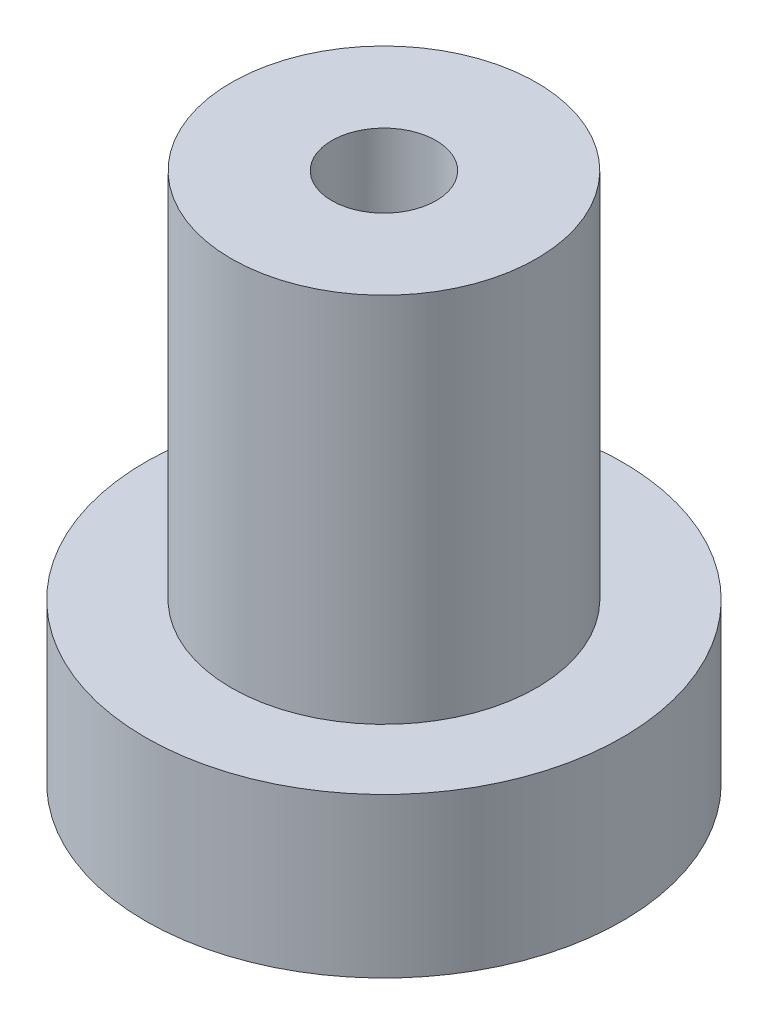
ISO-10303-21;
HEADER;
FILE_DESCRIPTION(('STEP AP214'),'2;1');
FILE_NAME('part.step','',(''),(''),'','','');
FILE_SCHEMA(('AUTOMOTIVE_DESIGN { 1 0 10303 214 1 1 1 1 }'));
ENDSEC;
DATA;
#1=APPLICATION_CONTEXT('core data for automotive mechanical design processes');
#2=APPLICATION_PROTOCOL_DEFINITION('international standard','automotive_design',2000,#1);
#3=PRODUCT_CONTEXT('',#1,'mechanical');
#4=PRODUCT('Part','Part','',(#3));
#5=PRODUCT_RELATED_PRODUCT_CATEGORY('part','',(#4));
#6=PRODUCT_DEFINITION_FORMATION('','',#4);
#7=PRODUCT_DEFINITION_CONTEXT('part definition',#1,'design');
#8=PRODUCT_DEFINITION('design','',#6,#7);
#9=PRODUCT_DEFINITION_SHAPE('','',#8);
#10=(LENGTH_UNIT() NAMED_UNIT(*) SI_UNIT(.MILLI.,.METRE.));
#11=(NAMED_UNIT(*) PLANE_ANGLE_UNIT() SI_UNIT($,.RADIAN.));
#12=(NAMED_UNIT(*) SI_UNIT($,.STERADIAN.) SOLID_ANGLE_UNIT());
#13=UNCERTAINTY_MEASURE_WITH_UNIT(LENGTH_MEASURE(1.E-05),#10,'distance_accuracy_value','');
#14=(GEOMETRIC_REPRESENTATION_CONTEXT(3) GLOBAL_UNCERTAINTY_ASSIGNED_CONTEXT((#13)) GLOBAL_UNIT_ASSIGNED_CONTEXT((#10,
#11,#12)) REPRESENTATION_CONTEXT('',''));
#15=CARTESIAN_POINT('',(0.,0.,0.));
#16=DIRECTION('',(0.,0.,1.));
#17=DIRECTION('',(1.,0.,0.));
#18=AXIS2_PLACEMENT_3D('',#15,#16,#17);
#19=CARTESIAN_POINT('',(0.,21.193,0.));
#20=DIRECTION('',(0.,1.,0.));
#21=DIRECTION('',(0.,0.,1.));
#22=AXIS2_PLACEMENT_3D('',#19,#20,#21);
#23=CYLINDRICAL_SURFACE('',#22,2.08279999999999);
#24=CARTESIAN_POINT('',(0.,21.193,0.));
#25=DIRECTION('',(0.,1.,0.));
#26=DIRECTION('',(0.,0.,1.));
#27=AXIS2_PLACEMENT_3D('',#24,#25,#26);
#28=CIRCLE('',#27,2.08279999999999);
#29=CARTESIAN_POINT('',(0.,21.193,2.08279999999999));
#30=VERTEX_POINT('',#29);
#31=EDGE_CURVE('E146',#30,#30,#28,.T.);
#32=ORIENTED_EDGE('',*,*,#31,.T.);
#33=EDGE_LOOP('',(#32));
#34=FACE_BOUND('',#33,.T.);
#35=CARTESIAN_POINT('',(0.,3.556,0.));
#36=DIRECTION('',(0.,-1.,0.));
#37=DIRECTION('',(0.,0.,-1.));
#38=AXIS2_PLACEMENT_3D('',#35,#36,#37);
#39=CIRCLE('',#38,2.08279999999999);
#40=CARTESIAN_POINT('',(0.,3.556,-2.08279999999999));
#41=VERTEX_POINT('',#40);
#42=EDGE_CURVE('E41',#41,#41,#39,.F.);
#43=ORIENTED_EDGE('',*,*,#42,.F.);
#44=EDGE_LOOP('',(#43));
#45=FACE_BOUND('',#44,.T.);
#46=ADVANCED_FACE('F37',(#34,#45),#23,.F.);
#47=CARTESIAN_POINT('',(0.,0.,0.));
#48=DIRECTION('',(0.,1.,0.));
#49=DIRECTION('',(0.,0.,1.));
#50=AXIS2_PLACEMENT_3D('',#47,#48,#49);
#51=PLANE('',#50);
#52=DIRECTION('',(-0.999047500513866,0.,-0.0436358994063032));
#53=VECTOR('',#52,1.);
#54=CARTESIAN_POINT('',(2.36991595335153,0.,4.55274990608789));
#55=LINE('',#54,#53);
#56=CARTESIAN_POINT('',(2.36991595335153,0.,4.55274990608788));
#57=VERTEX_POINT('',#56);
#58=CARTESIAN_POINT('',(-2.75783909907356,0.,4.32878237348038));
#59=VERTEX_POINT('',#58);
#60=EDGE_CURVE('E128',#57,#59,#55,.T.);
#61=ORIENTED_EDGE('',*,*,#60,.F.);
#62=DIRECTION('',(-0.537313547659773,0.,0.843382565329204));
#63=VECTOR('',#62,1.);
#64=CARTESIAN_POINT('',(5.12775505242509,0.,0.223967532607504));
#65=LINE('',#64,#63);
#66=CARTESIAN_POINT('',(5.12775505242509,0.,0.223967532607504));
#67=VERTEX_POINT('',#66);
#68=EDGE_CURVE('E53',#67,#57,#65,.T.);
#69=ORIENTED_EDGE('',*,*,#68,.F.);
#70=DIRECTION('',(0.461733952854093,0.,0.887018464735506));
#71=VECTOR('',#70,1.);
#72=CARTESIAN_POINT('',(2.75783909907356,0.,-4.32878237348038));
#73=LINE('',#72,#71);
#74=CARTESIAN_POINT('',(2.75783909907356,0.,-4.32878237348038));
#75=VERTEX_POINT('',#74);
#76=EDGE_CURVE('E137',#75,#67,#73,.T.);
#77=ORIENTED_EDGE('',*,*,#76,.F.);
#78=DIRECTION('',(0.999047500513866,0.,0.0436358994063029));
#79=VECTOR('',#78,1.);
#80=CARTESIAN_POINT('',(-2.36991595335153,0.,-4.55274990608788));
#81=LINE('',#80,#79);
#82=CARTESIAN_POINT('',(-2.36991595335153,0.,-4.55274990608788));
#83=VERTEX_POINT('',#82);
#84=EDGE_CURVE('E135',#83,#75,#81,.T.);
#85=ORIENTED_EDGE('',*,*,#84,.F.);
#86=DIRECTION('',(0.537313547659773,0.,-0.843382565329204));
#87=VECTOR('',#86,1.);
#88=CARTESIAN_POINT('',(-5.12775505242509,0.,-0.223967532607501));
#89=LINE('',#88,#87);
#90=CARTESIAN_POINT('',(-5.12775505242509,0.,-0.223967532607501));
#91=VERTEX_POINT('',#90);
#92=EDGE_CURVE('E101',#91,#83,#89,.T.);
#93=ORIENTED_EDGE('',*,*,#92,.F.);
#94=DIRECTION('',(-0.461733952854092,0.,-0.887018464735506));
#95=VECTOR('',#94,1.);
#96=CARTESIAN_POINT('',(-2.75783909907356,0.,4.32878237348038));
#97=LINE('',#96,#95);
#98=EDGE_CURVE('E131',#59,#91,#97,.T.);
#99=ORIENTED_EDGE('',*,*,#98,.F.);
#100=EDGE_LOOP('',(#61,#69,#77,#85,#93,#99));
#101=FACE_BOUND('',#100,.T.);
#102=CARTESIAN_POINT('',(0.,0.,0.));
#103=DIRECTION('',(0.,1.,0.));
#104=DIRECTION('',(0.,0.,1.));
#105=AXIS2_PLACEMENT_3D('',#102,#103,#104);
#106=CIRCLE('',#105,9.525);
#107=CARTESIAN_POINT('',(0.,0.,9.525));
#108=VERTEX_POINT('',#107);
#109=EDGE_CURVE('E11',#108,#108,#106,.T.);
#110=ORIENTED_EDGE('',*,*,#109,.F.);
#111=EDGE_LOOP('',(#110));
#112=FACE_BOUND('',#111,.T.);
#113=ADVANCED_FACE('F39',(#101,#112),#51,.F.);
#114=CARTESIAN_POINT('',(0.,21.193,0.));
#115=DIRECTION('',(0.,1.,0.));
#116=DIRECTION('',(0.,0.,1.));
#117=AXIS2_PLACEMENT_3D('',#114,#115,#116);
#118=CYLINDRICAL_SURFACE('',#117,9.525);
#119=CARTESIAN_POINT('',(0.,6.35,0.));
#120=DIRECTION('',(0.,1.,0.));
#121=DIRECTION('',(0.,0.,1.));
#122=AXIS2_PLACEMENT_3D('',#119,#120,#121);
#123=CIRCLE('',#122,9.525);
#124=CARTESIAN_POINT('',(0.,6.35,9.525));
#125=VERTEX_POINT('',#124);
#126=EDGE_CURVE('E46',#125,#125,#123,.T.);
#127=ORIENTED_EDGE('',*,*,#126,.F.);
#128=EDGE_LOOP('',(#127));
#129=FACE_BOUND('',#128,.T.);
#130=ORIENTED_EDGE('',*,*,#109,.T.);
#131=EDGE_LOOP('',(#130));
#132=FACE_BOUND('',#131,.T.);
#133=ADVANCED_FACE('F160',(#129,#132),#118,.T.);
#134=CARTESIAN_POINT('',(9.525,6.35,0.));
#135=DIRECTION('',(0.,-1.,0.));
#136=DIRECTION('',(0.,0.,-1.));
#137=AXIS2_PLACEMENT_3D('',#134,#135,#136);
#138=PLANE('',#137);
#139=CARTESIAN_POINT('',(0.,6.35000000000001,0.));
#140=DIRECTION('',(0.,1.,0.));
#141=DIRECTION('',(0.,0.,1.));
#142=AXIS2_PLACEMENT_3D('',#139,#140,#141);
#143=CIRCLE('',#142,6.096);
#144=CARTESIAN_POINT('',(0.,6.35000000000001,6.096));
#145=VERTEX_POINT('',#144);
#146=EDGE_CURVE('E152',#145,#145,#143,.T.);
#147=ORIENTED_EDGE('',*,*,#146,.F.);
#148=EDGE_LOOP('',(#147));
#149=FACE_BOUND('',#148,.T.);
#150=ORIENTED_EDGE('',*,*,#126,.T.);
#151=EDGE_LOOP('',(#150));
#152=FACE_BOUND('',#151,.T.);
#153=ADVANCED_FACE('F158',(#149,#152),#138,.F.);
#154=CARTESIAN_POINT('',(0.,21.193,0.));
#155=DIRECTION('',(0.,1.,0.));
#156=DIRECTION('',(0.,0.,1.));
#157=AXIS2_PLACEMENT_3D('',#154,#155,#156);
#158=CYLINDRICAL_SURFACE('',#157,6.096);
#159=CARTESIAN_POINT('',(0.,21.193,0.));
#160=DIRECTION('',(0.,1.,0.));
#161=DIRECTION('',(0.,0.,1.));
#162=AXIS2_PLACEMENT_3D('',#159,#160,#161);
#163=CIRCLE('',#162,6.096);
#164=CARTESIAN_POINT('',(0.,21.193,6.096));
#165=VERTEX_POINT('',#164);
#166=EDGE_CURVE('E149',#165,#165,#163,.T.);
#167=ORIENTED_EDGE('',*,*,#166,.F.);
#168=EDGE_LOOP('',(#167));
#169=FACE_BOUND('',#168,.T.);
#170=ORIENTED_EDGE('',*,*,#146,.T.);
#171=EDGE_LOOP('',(#170));
#172=FACE_BOUND('',#171,.T.);
#173=ADVANCED_FACE('F194',(#169,#172),#158,.T.);
#174=CARTESIAN_POINT('',(6.096,21.193,0.));
#175=DIRECTION('',(0.,-1.,0.));
#176=DIRECTION('',(0.,0.,-1.));
#177=AXIS2_PLACEMENT_3D('',#174,#175,#176);
#178=PLANE('',#177);
#179=ORIENTED_EDGE('',*,*,#31,.F.);
#180=EDGE_LOOP('',(#179));
#181=FACE_BOUND('',#180,.T.);
#182=ORIENTED_EDGE('',*,*,#166,.T.);
#183=EDGE_LOOP('',(#182));
#184=FACE_BOUND('',#183,.T.);
#185=ADVANCED_FACE('F187',(#181,#184),#178,.F.);
#186=CARTESIAN_POINT('',(0.,3.556,0.));
#187=DIRECTION('',(0.,-1.,0.));
#188=DIRECTION('',(0.,0.,-1.));
#189=AXIS2_PLACEMENT_3D('',#186,#187,#188);
#190=PLANE('',#189);
#191=DIRECTION('',(-0.537313547659773,0.,0.843382565329204));
#192=VECTOR('',#191,1.);
#193=CARTESIAN_POINT('',(5.12775505242509,3.556,0.223967532607504));
#194=LINE('',#193,#192);
#195=CARTESIAN_POINT('',(5.12775505242509,3.556,0.223967532607504));
#196=VERTEX_POINT('',#195);
#197=CARTESIAN_POINT('',(2.36991595335153,3.556,4.55274990608789));
#198=VERTEX_POINT('',#197);
#199=EDGE_CURVE('E139',#196,#198,#194,.T.);
#200=ORIENTED_EDGE('',*,*,#199,.T.);
#201=DIRECTION('',(-0.999047500513866,0.,-0.0436358994063032));
#202=VECTOR('',#201,1.);
#203=CARTESIAN_POINT('',(2.36991595335153,3.556,4.55274990608789));
#204=LINE('',#203,#202);
#205=CARTESIAN_POINT('',(-2.75783909907356,3.556,4.32878237348038));
#206=VERTEX_POINT('',#205);
#207=EDGE_CURVE('E122',#198,#206,#204,.T.);
#208=ORIENTED_EDGE('',*,*,#207,.T.);
#209=DIRECTION('',(-0.461733952854092,0.,-0.887018464735506));
#210=VECTOR('',#209,1.);
#211=CARTESIAN_POINT('',(-2.75783909907356,3.556,4.32878237348038));
#212=LINE('',#211,#210);
#213=CARTESIAN_POINT('',(-5.12775505242509,3.556,-0.223967532607501));
#214=VERTEX_POINT('',#213);
#215=EDGE_CURVE('E120',#206,#214,#212,.T.);
#216=ORIENTED_EDGE('',*,*,#215,.T.);
#217=DIRECTION('',(0.537313547659773,0.,-0.843382565329204));
#218=VECTOR('',#217,1.);
#219=CARTESIAN_POINT('',(-5.12775505242509,3.556,-0.223967532607501));
#220=LINE('',#219,#218);
#221=CARTESIAN_POINT('',(-2.36991595335153,3.556,-4.55274990608788));
#222=VERTEX_POINT('',#221);
#223=EDGE_CURVE('E98',#214,#222,#220,.T.);
#224=ORIENTED_EDGE('',*,*,#223,.T.);
#225=DIRECTION('',(0.999047500513866,0.,0.0436358994063029));
#226=VECTOR('',#225,1.);
#227=CARTESIAN_POINT('',(-2.36991595335153,3.556,-4.55274990608788));
#228=LINE('',#227,#226);
#229=CARTESIAN_POINT('',(2.75783909907356,3.556,-4.32878237348038));
#230=VERTEX_POINT('',#229);
#231=EDGE_CURVE('E109',#222,#230,#228,.T.);
#232=ORIENTED_EDGE('',*,*,#231,.T.);
#233=DIRECTION('',(0.461733952854093,0.,0.887018464735506));
#234=VECTOR('',#233,1.);
#235=CARTESIAN_POINT('',(2.75783909907356,3.556,-4.32878237348038));
#236=LINE('',#235,#234);
#237=EDGE_CURVE('E113',#230,#196,#236,.T.);
#238=ORIENTED_EDGE('',*,*,#237,.T.);
#239=EDGE_LOOP('',(#200,#208,#216,#224,#232,#238));
#240=FACE_BOUND('',#239,.T.);
#241=ORIENTED_EDGE('',*,*,#42,.T.);
#242=EDGE_LOOP('',(#241));
#243=FACE_BOUND('',#242,.T.);
#244=ADVANCED_FACE('F116',(#240,#243),#190,.T.);
#245=CARTESIAN_POINT('',(5.12775505242509,3.556,0.223967532607504));
#246=DIRECTION('',(0.843382565329204,0.,0.537313547659773));
#247=DIRECTION('',(0.537313547659773,0.,-0.843382565329204));
#248=AXIS2_PLACEMENT_3D('',#245,#246,#247);
#249=PLANE('',#248);
#250=ORIENTED_EDGE('',*,*,#68,.T.);
#251=DIRECTION('',(0.,-1.,0.));
#252=VECTOR('',#251,1.);
#253=CARTESIAN_POINT('',(2.36991595335153,3.556,4.55274990608789));
#254=LINE('',#253,#252);
#255=EDGE_CURVE('E83',#198,#57,#254,.T.);
#256=ORIENTED_EDGE('',*,*,#255,.F.);
#257=ORIENTED_EDGE('',*,*,#199,.F.);
#258=DIRECTION('',(0.,-1.,0.));
#259=VECTOR('',#258,1.);
#260=CARTESIAN_POINT('',(5.12775505242509,3.556,0.223967532607504));
#261=LINE('',#260,#259);
#262=EDGE_CURVE('E61',#196,#67,#261,.T.);
#263=ORIENTED_EDGE('',*,*,#262,.T.);
#264=EDGE_LOOP('',(#250,#256,#257,#263));
#265=FACE_BOUND('',#264,.T.);
#266=ADVANCED_FACE('F178',(#265),#249,.F.);
#267=CARTESIAN_POINT('',(2.75783909907356,3.556,-4.32878237348038));
#268=DIRECTION('',(0.887018464735506,0.,-0.461733952854093));
#269=DIRECTION('',(-0.461733952854092,0.,-0.887018464735506));
#270=AXIS2_PLACEMENT_3D('',#267,#268,#269);
#271=PLANE('',#270);
#272=ORIENTED_EDGE('',*,*,#76,.T.);
#273=ORIENTED_EDGE('',*,*,#262,.F.);
#274=ORIENTED_EDGE('',*,*,#237,.F.);
#275=DIRECTION('',(0.,-1.,0.));
#276=VECTOR('',#275,1.);
#277=CARTESIAN_POINT('',(2.75783909907356,3.556,-4.32878237348038));
#278=LINE('',#277,#276);
#279=EDGE_CURVE('E105',#230,#75,#278,.T.);
#280=ORIENTED_EDGE('',*,*,#279,.T.);
#281=EDGE_LOOP('',(#272,#273,#274,#280));
#282=FACE_BOUND('',#281,.T.);
#283=ADVANCED_FACE('F180',(#282),#271,.F.);
#284=CARTESIAN_POINT('',(-2.36991595335153,3.556,-4.55274990608788));
#285=DIRECTION('',(0.0436358994063029,0.,-0.999047500513866));
#286=DIRECTION('',(-0.999047500513866,0.,-0.0436358994063029));
#287=AXIS2_PLACEMENT_3D('',#284,#285,#286);
#288=PLANE('',#287);
#289=ORIENTED_EDGE('',*,*,#84,.T.);
#290=ORIENTED_EDGE('',*,*,#279,.F.);
#291=ORIENTED_EDGE('',*,*,#231,.F.);
#292=DIRECTION('',(0.,-1.,0.));
#293=VECTOR('',#292,1.);
#294=CARTESIAN_POINT('',(-2.36991595335153,3.556,-4.55274990608788));
#295=LINE('',#294,#293);
#296=EDGE_CURVE('E94',#222,#83,#295,.T.);
#297=ORIENTED_EDGE('',*,*,#296,.T.);
#298=EDGE_LOOP('',(#289,#290,#291,#297));
#299=FACE_BOUND('',#298,.T.);
#300=ADVANCED_FACE('F110',(#299),#288,.F.);
#301=CARTESIAN_POINT('',(-5.12775505242509,3.556,-0.223967532607501));
#302=DIRECTION('',(-0.843382565329204,0.,-0.537313547659773));
#303=DIRECTION('',(-0.537313547659773,0.,0.843382565329204));
#304=AXIS2_PLACEMENT_3D('',#301,#302,#303);
#305=PLANE('',#304);
#306=ORIENTED_EDGE('',*,*,#92,.T.);
#307=ORIENTED_EDGE('',*,*,#296,.F.);
#308=ORIENTED_EDGE('',*,*,#223,.F.);
#309=DIRECTION('',(0.,-1.,0.));
#310=VECTOR('',#309,1.);
#311=CARTESIAN_POINT('',(-5.12775505242509,3.556,-0.223967532607501));
#312=LINE('',#311,#310);
#313=EDGE_CURVE('E106',#214,#91,#312,.T.);
#314=ORIENTED_EDGE('',*,*,#313,.T.);
#315=EDGE_LOOP('',(#306,#307,#308,#314));
#316=FACE_BOUND('',#315,.T.);
#317=ADVANCED_FACE('F96',(#316),#305,.F.);
#318=CARTESIAN_POINT('',(-2.75783909907356,3.556,4.32878237348038));
#319=DIRECTION('',(-0.887018464735506,0.,0.461733952854093));
#320=DIRECTION('',(0.461733952854092,0.,0.887018464735506));
#321=AXIS2_PLACEMENT_3D('',#318,#319,#320);
#322=PLANE('',#321);
#323=ORIENTED_EDGE('',*,*,#98,.T.);
#324=ORIENTED_EDGE('',*,*,#313,.F.);
#325=ORIENTED_EDGE('',*,*,#215,.F.);
#326=DIRECTION('',(0.,-1.,0.));
#327=VECTOR('',#326,1.);
#328=CARTESIAN_POINT('',(-2.75783909907356,3.556,4.32878237348038));
#329=LINE('',#328,#327);
#330=EDGE_CURVE('E143',#206,#59,#329,.T.);
#331=ORIENTED_EDGE('',*,*,#330,.T.);
#332=EDGE_LOOP('',(#323,#324,#325,#331));
#333=FACE_BOUND('',#332,.T.);
#334=ADVANCED_FACE('F250',(#333),#322,.F.);
#335=CARTESIAN_POINT('',(2.36991595335153,3.556,4.55274990608789));
#336=DIRECTION('',(-0.0436358994063032,0.,0.999047500513866));
#337=DIRECTION('',(0.999047500513866,0.,0.0436358994063032));
#338=AXIS2_PLACEMENT_3D('',#335,#336,#337);
#339=PLANE('',#338);
#340=ORIENTED_EDGE('',*,*,#60,.T.);
#341=ORIENTED_EDGE('',*,*,#330,.F.);
#342=ORIENTED_EDGE('',*,*,#207,.F.);
#343=ORIENTED_EDGE('',*,*,#255,.T.);
#344=EDGE_LOOP('',(#340,#341,#342,#343));
#345=FACE_BOUND('',#344,.T.);
#346=ADVANCED_FACE('F176',(#345),#339,.F.);
#347=CLOSED_SHELL('',(#46,#113,#133,#153,#173,#185,#244,#266,#283,#300,#317,#334,#346));
#348=MANIFOLD_SOLID_BREP('B2',#347);
#349=ADVANCED_BREP_SHAPE_REPRESENTATION('',(#18,#348),#14);
#350=SHAPE_DEFINITION_REPRESENTATION(#9,#349);
ENDSEC;
END-ISO-10303-21;
